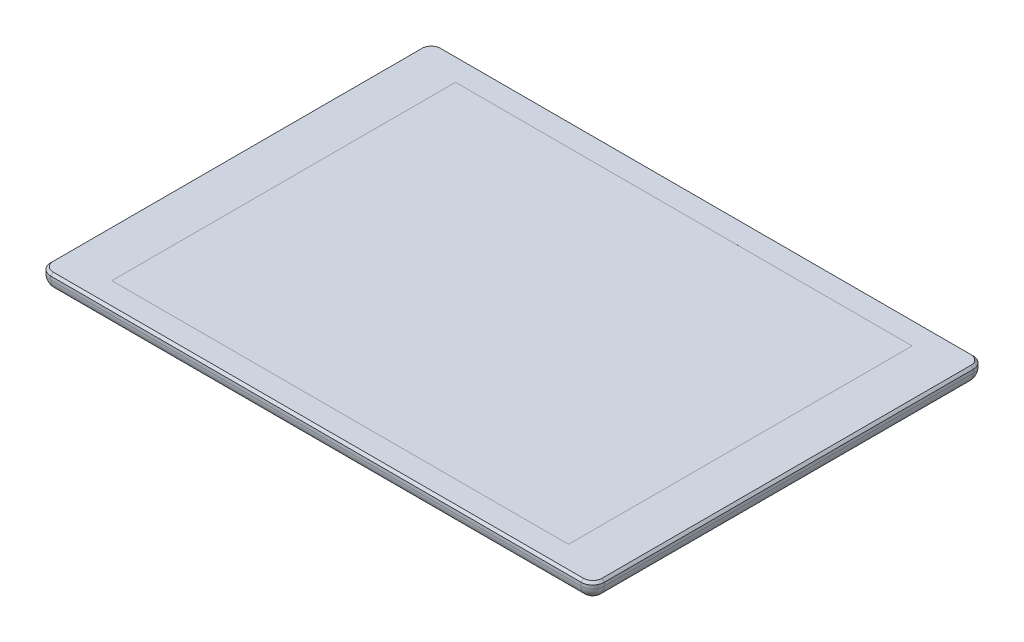
ISO-10303-21;
HEADER;
FILE_DESCRIPTION(('STEP AP214'),'2;1');
FILE_NAME('part.step','',(''),(''),'','','');
FILE_SCHEMA(('AUTOMOTIVE_DESIGN { 1 0 10303 214 1 1 1 1 }'));
ENDSEC;
DATA;
#1=APPLICATION_CONTEXT('core data for automotive mechanical design processes');
#2=APPLICATION_PROTOCOL_DEFINITION('international standard','automotive_design',2000,#1);
#3=PRODUCT_CONTEXT('',#1,'mechanical');
#4=PRODUCT('Part','Part','',(#3));
#5=PRODUCT_RELATED_PRODUCT_CATEGORY('part','',(#4));
#6=PRODUCT_DEFINITION_FORMATION('','',#4);
#7=PRODUCT_DEFINITION_CONTEXT('part definition',#1,'design');
#8=PRODUCT_DEFINITION('design','',#6,#7);
#9=PRODUCT_DEFINITION_SHAPE('','',#8);
#10=(LENGTH_UNIT() NAMED_UNIT(*) SI_UNIT(.MILLI.,.METRE.));
#11=(NAMED_UNIT(*) PLANE_ANGLE_UNIT() SI_UNIT($,.RADIAN.));
#12=(NAMED_UNIT(*) SI_UNIT($,.STERADIAN.) SOLID_ANGLE_UNIT());
#13=UNCERTAINTY_MEASURE_WITH_UNIT(LENGTH_MEASURE(1.E-05),#10,'distance_accuracy_value','');
#14=(GEOMETRIC_REPRESENTATION_CONTEXT(3) GLOBAL_UNCERTAINTY_ASSIGNED_CONTEXT((#13)) GLOBAL_UNIT_ASSIGNED_CONTEXT((#10,
#11,#12)) REPRESENTATION_CONTEXT('',''));
#15=CARTESIAN_POINT('',(0.,0.,0.));
#16=DIRECTION('',(0.,0.,1.));
#17=DIRECTION('',(1.,0.,0.));
#18=AXIS2_PLACEMENT_3D('',#15,#16,#17);
#19=CARTESIAN_POINT('',(5.,7.5,-5.));
#20=DIRECTION('',(0.,-1.,0.));
#21=DIRECTION('',(0.,0.,-1.));
#22=AXIS2_PLACEMENT_3D('',#19,#20,#21);
#23=CYLINDRICAL_SURFACE('',#22,5.);
#24=DIRECTION('',(0.,-1.,0.));
#25=VECTOR('',#24,1.);
#26=CARTESIAN_POINT('',(5.00000000000004,7.5,0.));
#27=LINE('',#26,#25);
#28=CARTESIAN_POINT('',(5.00000000000004,6.50000000000001,0.));
#29=VERTEX_POINT('',#28);
#30=CARTESIAN_POINT('',(5.00000000000004,5.,0.));
#31=VERTEX_POINT('',#30);
#32=EDGE_CURVE('E225',#29,#31,#27,.T.);
#33=ORIENTED_EDGE('',*,*,#32,.F.);
#34=CARTESIAN_POINT('',(5.,6.50000000000001,-5.));
#35=DIRECTION('',(0.,1.,0.));
#36=DIRECTION('',(0.,0.,1.));
#37=AXIS2_PLACEMENT_3D('',#34,#35,#36);
#38=CIRCLE('',#37,5.);
#39=CARTESIAN_POINT('',(0.,6.50000000000001,-5.00000000000004));
#40=VERTEX_POINT('',#39);
#41=EDGE_CURVE('E11',#29,#40,#38,.F.);
#42=ORIENTED_EDGE('',*,*,#41,.T.);
#43=DIRECTION('',(0.,-1.,0.));
#44=VECTOR('',#43,1.);
#45=CARTESIAN_POINT('',(0.,7.5,-5.00000000000004));
#46=LINE('',#45,#44);
#47=CARTESIAN_POINT('',(0.,5.,-5.00000000000004));
#48=VERTEX_POINT('',#47);
#49=EDGE_CURVE('E210',#40,#48,#46,.T.);
#50=ORIENTED_EDGE('',*,*,#49,.T.);
#51=CARTESIAN_POINT('',(5.,5.,-5.));
#52=DIRECTION('',(0.,-1.,0.));
#53=DIRECTION('',(0.,0.,-1.));
#54=AXIS2_PLACEMENT_3D('',#51,#52,#53);
#55=CIRCLE('',#54,5.);
#56=EDGE_CURVE('E257',#48,#31,#55,.F.);
#57=ORIENTED_EDGE('',*,*,#56,.T.);
#58=EDGE_LOOP('',(#33,#42,#50,#57));
#59=FACE_BOUND('',#58,.T.);
#60=ADVANCED_FACE('F43',(#59),#23,.T.);
#61=CARTESIAN_POINT('',(5.00000000000004,7.5,0.));
#62=DIRECTION('',(0.,0.,-1.));
#63=DIRECTION('',(-1.,0.,0.));
#64=AXIS2_PLACEMENT_3D('',#61,#62,#63);
#65=PLANE('',#64);
#66=DIRECTION('',(0.,-1.,0.));
#67=VECTOR('',#66,1.);
#68=CARTESIAN_POINT('',(235.,7.5,0.));
#69=LINE('',#68,#67);
#70=CARTESIAN_POINT('',(235.,6.50000000000001,0.));
#71=VERTEX_POINT('',#70);
#72=CARTESIAN_POINT('',(235.,5.,0.));
#73=VERTEX_POINT('',#72);
#74=EDGE_CURVE('E223',#71,#73,#69,.T.);
#75=ORIENTED_EDGE('',*,*,#74,.F.);
#76=DIRECTION('',(-1.,0.,0.));
#77=VECTOR('',#76,1.);
#78=CARTESIAN_POINT('',(5.00000000000004,6.50000000000001,0.));
#79=LINE('',#78,#77);
#80=EDGE_CURVE('E52',#71,#29,#79,.T.);
#81=ORIENTED_EDGE('',*,*,#80,.T.);
#82=ORIENTED_EDGE('',*,*,#32,.T.);
#83=DIRECTION('',(1.,0.,0.));
#84=VECTOR('',#83,1.);
#85=CARTESIAN_POINT('',(5.00000000000004,5.,0.));
#86=LINE('',#85,#84);
#87=EDGE_CURVE('E227',#31,#73,#86,.T.);
#88=ORIENTED_EDGE('',*,*,#87,.T.);
#89=EDGE_LOOP('',(#75,#81,#82,#88));
#90=FACE_BOUND('',#89,.T.);
#91=ADVANCED_FACE('F427',(#90),#65,.F.);
#92=CARTESIAN_POINT('',(235.,7.5,-5.));
#93=DIRECTION('',(0.,-1.,0.));
#94=DIRECTION('',(0.,0.,-1.));
#95=AXIS2_PLACEMENT_3D('',#92,#93,#94);
#96=CYLINDRICAL_SURFACE('',#95,5.);
#97=DIRECTION('',(0.,-1.,0.));
#98=VECTOR('',#97,1.);
#99=CARTESIAN_POINT('',(240.,7.5,-5.00000000000004));
#100=LINE('',#99,#98);
#101=CARTESIAN_POINT('',(240.,6.50000000000001,-5.00000000000004));
#102=VERTEX_POINT('',#101);
#103=CARTESIAN_POINT('',(240.,5.,-5.00000000000004));
#104=VERTEX_POINT('',#103);
#105=EDGE_CURVE('E221',#102,#104,#100,.T.);
#106=ORIENTED_EDGE('',*,*,#105,.F.);
#107=CARTESIAN_POINT('',(235.,6.50000000000001,-5.));
#108=DIRECTION('',(0.,1.,0.));
#109=DIRECTION('',(0.,0.,1.));
#110=AXIS2_PLACEMENT_3D('',#107,#108,#109);
#111=CIRCLE('',#110,5.);
#112=EDGE_CURVE('E310',#102,#71,#111,.F.);
#113=ORIENTED_EDGE('',*,*,#112,.T.);
#114=ORIENTED_EDGE('',*,*,#74,.T.);
#115=CARTESIAN_POINT('',(235.,5.,-5.));
#116=DIRECTION('',(0.,-1.,0.));
#117=DIRECTION('',(0.,0.,-1.));
#118=AXIS2_PLACEMENT_3D('',#115,#116,#117);
#119=CIRCLE('',#118,5.);
#120=EDGE_CURVE('E239',#73,#104,#119,.F.);
#121=ORIENTED_EDGE('',*,*,#120,.T.);
#122=EDGE_LOOP('',(#106,#113,#114,#121));
#123=FACE_BOUND('',#122,.T.);
#124=ADVANCED_FACE('F348',(#123),#96,.T.);
#125=CARTESIAN_POINT('',(240.,7.5,-5.00000000000004));
#126=DIRECTION('',(-1.,0.,0.));
#127=DIRECTION('',(0.,0.,1.));
#128=AXIS2_PLACEMENT_3D('',#125,#126,#127);
#129=PLANE('',#128);
#130=DIRECTION('',(0.,-1.,0.));
#131=VECTOR('',#130,1.);
#132=CARTESIAN_POINT('',(240.,7.5,-165.));
#133=LINE('',#132,#131);
#134=CARTESIAN_POINT('',(240.,6.50000000000001,-165.));
#135=VERTEX_POINT('',#134);
#136=CARTESIAN_POINT('',(240.,5.,-165.));
#137=VERTEX_POINT('',#136);
#138=EDGE_CURVE('E219',#135,#137,#133,.T.);
#139=ORIENTED_EDGE('',*,*,#138,.F.);
#140=DIRECTION('',(0.,0.,1.));
#141=VECTOR('',#140,1.);
#142=CARTESIAN_POINT('',(240.,6.50000000000001,-5.00000000000004));
#143=LINE('',#142,#141);
#144=EDGE_CURVE('E308',#135,#102,#143,.T.);
#145=ORIENTED_EDGE('',*,*,#144,.T.);
#146=ORIENTED_EDGE('',*,*,#105,.T.);
#147=DIRECTION('',(0.,0.,-1.));
#148=VECTOR('',#147,1.);
#149=CARTESIAN_POINT('',(240.,5.,-5.00000000000004));
#150=LINE('',#149,#148);
#151=EDGE_CURVE('E242',#104,#137,#150,.T.);
#152=ORIENTED_EDGE('',*,*,#151,.T.);
#153=EDGE_LOOP('',(#139,#145,#146,#152));
#154=FACE_BOUND('',#153,.T.);
#155=ADVANCED_FACE('F346',(#154),#129,.F.);
#156=CARTESIAN_POINT('',(235.,7.5,-165.));
#157=DIRECTION('',(0.,-1.,0.));
#158=DIRECTION('',(0.,0.,-1.));
#159=AXIS2_PLACEMENT_3D('',#156,#157,#158);
#160=CYLINDRICAL_SURFACE('',#159,5.);
#161=DIRECTION('',(0.,-1.,0.));
#162=VECTOR('',#161,1.);
#163=CARTESIAN_POINT('',(235.,7.5,-170.));
#164=LINE('',#163,#162);
#165=CARTESIAN_POINT('',(235.,6.50000000000001,-170.));
#166=VERTEX_POINT('',#165);
#167=CARTESIAN_POINT('',(235.,5.,-170.));
#168=VERTEX_POINT('',#167);
#169=EDGE_CURVE('E217',#166,#168,#164,.T.);
#170=ORIENTED_EDGE('',*,*,#169,.F.);
#171=CARTESIAN_POINT('',(235.,6.50000000000001,-165.));
#172=DIRECTION('',(0.,1.,0.));
#173=DIRECTION('',(0.,0.,1.));
#174=AXIS2_PLACEMENT_3D('',#171,#172,#173);
#175=CIRCLE('',#174,5.);
#176=EDGE_CURVE('E306',#166,#135,#175,.F.);
#177=ORIENTED_EDGE('',*,*,#176,.T.);
#178=ORIENTED_EDGE('',*,*,#138,.T.);
#179=CARTESIAN_POINT('',(235.,5.,-165.));
#180=DIRECTION('',(0.,-1.,0.));
#181=DIRECTION('',(0.,0.,-1.));
#182=AXIS2_PLACEMENT_3D('',#179,#180,#181);
#183=CIRCLE('',#182,5.);
#184=EDGE_CURVE('E245',#137,#168,#183,.F.);
#185=ORIENTED_EDGE('',*,*,#184,.T.);
#186=EDGE_LOOP('',(#170,#177,#178,#185));
#187=FACE_BOUND('',#186,.T.);
#188=ADVANCED_FACE('F378',(#187),#160,.T.);
#189=CARTESIAN_POINT('',(5.00000000000004,7.5,-170.));
#190=DIRECTION('',(0.,0.,1.));
#191=DIRECTION('',(1.,0.,0.));
#192=AXIS2_PLACEMENT_3D('',#189,#190,#191);
#193=PLANE('',#192);
#194=DIRECTION('',(0.,-1.,0.));
#195=VECTOR('',#194,1.);
#196=CARTESIAN_POINT('',(5.00000000000004,7.5,-170.));
#197=LINE('',#196,#195);
#198=CARTESIAN_POINT('',(5.00000000000004,6.50000000000001,-170.));
#199=VERTEX_POINT('',#198);
#200=CARTESIAN_POINT('',(5.00000000000004,5.,-170.));
#201=VERTEX_POINT('',#200);
#202=EDGE_CURVE('E215',#199,#201,#197,.T.);
#203=ORIENTED_EDGE('',*,*,#202,.F.);
#204=DIRECTION('',(1.,0.,0.));
#205=VECTOR('',#204,1.);
#206=CARTESIAN_POINT('',(235.,6.50000000000001,-170.));
#207=LINE('',#206,#205);
#208=EDGE_CURVE('E304',#199,#166,#207,.T.);
#209=ORIENTED_EDGE('',*,*,#208,.T.);
#210=ORIENTED_EDGE('',*,*,#169,.T.);
#211=DIRECTION('',(-1.,0.,0.));
#212=VECTOR('',#211,1.);
#213=CARTESIAN_POINT('',(5.00000000000004,5.,-170.));
#214=LINE('',#213,#212);
#215=EDGE_CURVE('E248',#168,#201,#214,.T.);
#216=ORIENTED_EDGE('',*,*,#215,.T.);
#217=EDGE_LOOP('',(#203,#209,#210,#216));
#218=FACE_BOUND('',#217,.T.);
#219=ADVANCED_FACE('F381',(#218),#193,.F.);
#220=CARTESIAN_POINT('',(5.,7.5,-165.));
#221=DIRECTION('',(0.,-1.,0.));
#222=DIRECTION('',(0.,0.,-1.));
#223=AXIS2_PLACEMENT_3D('',#220,#221,#222);
#224=CYLINDRICAL_SURFACE('',#223,5.);
#225=DIRECTION('',(0.,-1.,0.));
#226=VECTOR('',#225,1.);
#227=CARTESIAN_POINT('',(0.,7.5,-165.));
#228=LINE('',#227,#226);
#229=CARTESIAN_POINT('',(0.,6.50000000000001,-165.));
#230=VERTEX_POINT('',#229);
#231=CARTESIAN_POINT('',(0.,5.,-165.));
#232=VERTEX_POINT('',#231);
#233=EDGE_CURVE('E212',#230,#232,#228,.T.);
#234=ORIENTED_EDGE('',*,*,#233,.F.);
#235=CARTESIAN_POINT('',(5.,6.50000000000001,-165.));
#236=DIRECTION('',(0.,1.,0.));
#237=DIRECTION('',(0.,0.,1.));
#238=AXIS2_PLACEMENT_3D('',#235,#236,#237);
#239=CIRCLE('',#238,5.);
#240=EDGE_CURVE('E302',#230,#199,#239,.F.);
#241=ORIENTED_EDGE('',*,*,#240,.T.);
#242=ORIENTED_EDGE('',*,*,#202,.T.);
#243=CARTESIAN_POINT('',(5.,5.,-165.));
#244=DIRECTION('',(0.,-1.,0.));
#245=DIRECTION('',(0.,0.,-1.));
#246=AXIS2_PLACEMENT_3D('',#243,#244,#245);
#247=CIRCLE('',#246,5.);
#248=EDGE_CURVE('E251',#201,#232,#247,.F.);
#249=ORIENTED_EDGE('',*,*,#248,.T.);
#250=EDGE_LOOP('',(#234,#241,#242,#249));
#251=FACE_BOUND('',#250,.T.);
#252=ADVANCED_FACE('F467',(#251),#224,.T.);
#253=CARTESIAN_POINT('',(0.,7.5,-5.00000000000004));
#254=DIRECTION('',(1.,0.,0.));
#255=DIRECTION('',(0.,0.,-1.));
#256=AXIS2_PLACEMENT_3D('',#253,#254,#255);
#257=PLANE('',#256);
#258=ORIENTED_EDGE('',*,*,#49,.F.);
#259=DIRECTION('',(0.,0.,-1.));
#260=VECTOR('',#259,1.);
#261=CARTESIAN_POINT('',(0.,6.50000000000001,-165.));
#262=LINE('',#261,#260);
#263=EDGE_CURVE('E299',#40,#230,#262,.T.);
#264=ORIENTED_EDGE('',*,*,#263,.T.);
#265=ORIENTED_EDGE('',*,*,#233,.T.);
#266=DIRECTION('',(0.,0.,1.));
#267=VECTOR('',#266,1.);
#268=CARTESIAN_POINT('',(0.,5.,-5.00000000000004));
#269=LINE('',#268,#267);
#270=EDGE_CURVE('E254',#232,#48,#269,.T.);
#271=ORIENTED_EDGE('',*,*,#270,.T.);
#272=EDGE_LOOP('',(#258,#264,#265,#271));
#273=FACE_BOUND('',#272,.T.);
#274=ADVANCED_FACE('F410',(#273),#257,.F.);
#275=CARTESIAN_POINT('',(5.,7.5,-5.));
#276=DIRECTION('',(0.,1.,0.));
#277=DIRECTION('',(0.,0.,1.));
#278=AXIS2_PLACEMENT_3D('',#275,#276,#277);
#279=PLANE('',#278);
#280=DIRECTION('',(0.,0.,1.));
#281=VECTOR('',#280,1.);
#282=CARTESIAN_POINT('',(21.,7.5,-10.5));
#283=LINE('',#282,#281);
#284=CARTESIAN_POINT('',(21.,7.5,-159.5));
#285=VERTEX_POINT('',#284);
#286=CARTESIAN_POINT('',(21.,7.5,-10.5));
#287=VERTEX_POINT('',#286);
#288=EDGE_CURVE('E60',#285,#287,#283,.T.);
#289=ORIENTED_EDGE('',*,*,#288,.F.);
#290=DIRECTION('',(-1.,0.,0.));
#291=VECTOR('',#290,1.);
#292=CARTESIAN_POINT('',(21.,7.5,-159.5));
#293=LINE('',#292,#291);
#294=CARTESIAN_POINT('',(219.,7.5,-159.5));
#295=VERTEX_POINT('',#294);
#296=EDGE_CURVE('E190',#295,#285,#293,.T.);
#297=ORIENTED_EDGE('',*,*,#296,.F.);
#298=DIRECTION('',(0.,0.,-1.));
#299=VECTOR('',#298,1.);
#300=CARTESIAN_POINT('',(219.,7.5,-10.5));
#301=LINE('',#300,#299);
#302=CARTESIAN_POINT('',(219.,7.5,-10.5));
#303=VERTEX_POINT('',#302);
#304=EDGE_CURVE('E194',#303,#295,#301,.T.);
#305=ORIENTED_EDGE('',*,*,#304,.F.);
#306=DIRECTION('',(1.,0.,0.));
#307=VECTOR('',#306,1.);
#308=CARTESIAN_POINT('',(21.,7.5,-10.5));
#309=LINE('',#308,#307);
#310=EDGE_CURVE('E200',#287,#303,#309,.T.);
#311=ORIENTED_EDGE('',*,*,#310,.F.);
#312=EDGE_LOOP('',(#289,#297,#305,#311));
#313=FACE_BOUND('',#312,.T.);
#314=CARTESIAN_POINT('',(5.,7.5,-165.));
#315=DIRECTION('',(0.,1.,0.));
#316=DIRECTION('',(0.,0.,1.));
#317=AXIS2_PLACEMENT_3D('',#314,#315,#316);
#318=CIRCLE('',#317,4.00000000000003);
#319=CARTESIAN_POINT('',(5.00000000000003,7.5,-169.));
#320=VERTEX_POINT('',#319);
#321=CARTESIAN_POINT('',(0.999999999999972,7.5,-165.));
#322=VERTEX_POINT('',#321);
#323=EDGE_CURVE('E294',#320,#322,#318,.T.);
#324=ORIENTED_EDGE('',*,*,#323,.T.);
#325=DIRECTION('',(0.,0.,1.));
#326=VECTOR('',#325,1.);
#327=CARTESIAN_POINT('',(0.999999999999976,7.5,-5.00000000000004));
#328=LINE('',#327,#326);
#329=CARTESIAN_POINT('',(0.999999999999976,7.5,-5.00000000000004));
#330=VERTEX_POINT('',#329);
#331=EDGE_CURVE('E296',#322,#330,#328,.T.);
#332=ORIENTED_EDGE('',*,*,#331,.T.);
#333=CARTESIAN_POINT('',(5.,7.5,-5.));
#334=DIRECTION('',(0.,1.,0.));
#335=DIRECTION('',(0.,0.,1.));
#336=AXIS2_PLACEMENT_3D('',#333,#334,#335);
#337=CIRCLE('',#336,4.00000000000002);
#338=CARTESIAN_POINT('',(5.00000000000004,7.5,-0.999999999999976));
#339=VERTEX_POINT('',#338);
#340=EDGE_CURVE('E260',#330,#339,#337,.T.);
#341=ORIENTED_EDGE('',*,*,#340,.T.);
#342=DIRECTION('',(1.,0.,0.));
#343=VECTOR('',#342,1.);
#344=CARTESIAN_POINT('',(235.,7.5,-0.999999999999976));
#345=LINE('',#344,#343);
#346=CARTESIAN_POINT('',(235.,7.5,-0.999999999999976));
#347=VERTEX_POINT('',#346);
#348=EDGE_CURVE('E284',#339,#347,#345,.T.);
#349=ORIENTED_EDGE('',*,*,#348,.T.);
#350=CARTESIAN_POINT('',(235.,7.5,-5.));
#351=DIRECTION('',(0.,1.,0.));
#352=DIRECTION('',(0.,0.,1.));
#353=AXIS2_PLACEMENT_3D('',#350,#351,#352);
#354=CIRCLE('',#353,4.00000000000003);
#355=CARTESIAN_POINT('',(239.,7.5,-5.00000000000004));
#356=VERTEX_POINT('',#355);
#357=EDGE_CURVE('E286',#347,#356,#354,.T.);
#358=ORIENTED_EDGE('',*,*,#357,.T.);
#359=DIRECTION('',(0.,0.,-1.));
#360=VECTOR('',#359,1.);
#361=CARTESIAN_POINT('',(239.,7.5,-165.));
#362=LINE('',#361,#360);
#363=CARTESIAN_POINT('',(239.,7.5,-165.));
#364=VERTEX_POINT('',#363);
#365=EDGE_CURVE('E288',#356,#364,#362,.T.);
#366=ORIENTED_EDGE('',*,*,#365,.T.);
#367=CARTESIAN_POINT('',(235.,7.5,-165.));
#368=DIRECTION('',(0.,1.,0.));
#369=DIRECTION('',(0.,0.,1.));
#370=AXIS2_PLACEMENT_3D('',#367,#368,#369);
#371=CIRCLE('',#370,4.00000000000003);
#372=CARTESIAN_POINT('',(235.,7.5,-169.));
#373=VERTEX_POINT('',#372);
#374=EDGE_CURVE('E290',#364,#373,#371,.T.);
#375=ORIENTED_EDGE('',*,*,#374,.T.);
#376=DIRECTION('',(-1.,0.,0.));
#377=VECTOR('',#376,1.);
#378=CARTESIAN_POINT('',(5.00000000000004,7.5,-169.));
#379=LINE('',#378,#377);
#380=EDGE_CURVE('E292',#373,#320,#379,.T.);
#381=ORIENTED_EDGE('',*,*,#380,.T.);
#382=EDGE_LOOP('',(#324,#332,#341,#349,#358,#366,#375,#381));
#383=FACE_BOUND('',#382,.T.);
#384=ADVANCED_FACE('F394',(#313,#383),#279,.T.);
#385=CARTESIAN_POINT('',(5.,0.,-5.));
#386=DIRECTION('',(0.,1.,0.));
#387=DIRECTION('',(0.,0.,1.));
#388=AXIS2_PLACEMENT_3D('',#385,#386,#387);
#389=PLANE('',#388);
#390=DIRECTION('',(0.,0.,-1.));
#391=VECTOR('',#390,1.);
#392=CARTESIAN_POINT('',(235.,0.,-5.));
#393=LINE('',#392,#391);
#394=CARTESIAN_POINT('',(235.,0.,-165.));
#395=VERTEX_POINT('',#394);
#396=CARTESIAN_POINT('',(235.,0.,-5.));
#397=VERTEX_POINT('',#396);
#398=EDGE_CURVE('E234',#395,#397,#393,.F.);
#399=ORIENTED_EDGE('',*,*,#398,.T.);
#400=DIRECTION('',(1.,0.,0.));
#401=VECTOR('',#400,1.);
#402=CARTESIAN_POINT('',(5.,0.,-5.));
#403=LINE('',#402,#401);
#404=CARTESIAN_POINT('',(5.,0.,-5.00000000000004));
#405=VERTEX_POINT('',#404);
#406=EDGE_CURVE('E236',#397,#405,#403,.F.);
#407=ORIENTED_EDGE('',*,*,#406,.T.);
#408=DIRECTION('',(0.,0.,1.));
#409=VECTOR('',#408,1.);
#410=CARTESIAN_POINT('',(5.,0.,-5.));
#411=LINE('',#410,#409);
#412=CARTESIAN_POINT('',(5.,0.,-165.));
#413=VERTEX_POINT('',#412);
#414=EDGE_CURVE('E230',#405,#413,#411,.F.);
#415=ORIENTED_EDGE('',*,*,#414,.T.);
#416=DIRECTION('',(-1.,0.,0.));
#417=VECTOR('',#416,1.);
#418=CARTESIAN_POINT('',(5.,0.,-165.));
#419=LINE('',#418,#417);
#420=EDGE_CURVE('E232',#413,#395,#419,.F.);
#421=ORIENTED_EDGE('',*,*,#420,.T.);
#422=EDGE_LOOP('',(#399,#407,#415,#421));
#423=FACE_BOUND('',#422,.T.);
#424=ADVANCED_FACE('F366',(#423),#389,.F.);
#425=CARTESIAN_POINT('',(5.00000000000004,5.,-165.));
#426=DIRECTION('',(-1.,0.,0.));
#427=DIRECTION('',(0.,0.,1.));
#428=AXIS2_PLACEMENT_3D('',#425,#426,#427);
#429=CYLINDRICAL_SURFACE('',#428,5.);
#430=CARTESIAN_POINT('',(5.00000000000004,5.,-165.));
#431=DIRECTION('',(-1.,0.,0.));
#432=DIRECTION('',(0.,0.,1.));
#433=AXIS2_PLACEMENT_3D('',#430,#431,#432);
#434=CIRCLE('',#433,5.);
#435=EDGE_CURVE('E213',#201,#413,#434,.T.);
#436=ORIENTED_EDGE('',*,*,#435,.F.);
#437=ORIENTED_EDGE('',*,*,#215,.F.);
#438=CARTESIAN_POINT('',(235.,5.,-165.));
#439=DIRECTION('',(1.,0.,0.));
#440=DIRECTION('',(0.,0.,-1.));
#441=AXIS2_PLACEMENT_3D('',#438,#439,#440);
#442=CIRCLE('',#441,5.);
#443=EDGE_CURVE('E278',#395,#168,#442,.T.);
#444=ORIENTED_EDGE('',*,*,#443,.F.);
#445=ORIENTED_EDGE('',*,*,#420,.F.);
#446=EDGE_LOOP('',(#436,#437,#444,#445));
#447=FACE_BOUND('',#446,.T.);
#448=ADVANCED_FACE('F373',(#447),#429,.T.);
#449=CARTESIAN_POINT('',(5.,5.,-165.));
#450=DIRECTION('',(0.,0.,1.));
#451=DIRECTION('',(1.,0.,0.));
#452=AXIS2_PLACEMENT_3D('',#449,#450,#451);
#453=SPHERICAL_SURFACE('',#452,5.);
#454=ORIENTED_EDGE('',*,*,#248,.F.);
#455=ORIENTED_EDGE('',*,*,#435,.T.);
#456=CARTESIAN_POINT('',(5.,5.,-165.));
#457=DIRECTION('',(0.,0.,1.));
#458=DIRECTION('',(1.,0.,0.));
#459=AXIS2_PLACEMENT_3D('',#456,#457,#458);
#460=CIRCLE('',#459,5.);
#461=EDGE_CURVE('E275',#232,#413,#460,.T.);
#462=ORIENTED_EDGE('',*,*,#461,.F.);
#463=EDGE_LOOP('',(#454,#455,#462));
#464=FACE_BOUND('',#463,.T.);
#465=ADVANCED_FACE('F451',(#464),#453,.T.);
#466=CARTESIAN_POINT('',(235.,5.,-165.));
#467=DIRECTION('',(0.,0.,1.));
#468=DIRECTION('',(1.,0.,0.));
#469=AXIS2_PLACEMENT_3D('',#466,#467,#468);
#470=SPHERICAL_SURFACE('',#469,5.);
#471=ORIENTED_EDGE('',*,*,#443,.T.);
#472=ORIENTED_EDGE('',*,*,#184,.F.);
#473=CARTESIAN_POINT('',(235.,5.,-165.));
#474=DIRECTION('',(0.,0.,1.));
#475=DIRECTION('',(1.,0.,0.));
#476=AXIS2_PLACEMENT_3D('',#473,#474,#475);
#477=CIRCLE('',#476,5.);
#478=EDGE_CURVE('E272',#395,#137,#477,.T.);
#479=ORIENTED_EDGE('',*,*,#478,.F.);
#480=EDGE_LOOP('',(#471,#472,#479));
#481=FACE_BOUND('',#480,.T.);
#482=ADVANCED_FACE('F375',(#481),#470,.T.);
#483=CARTESIAN_POINT('',(5.,5.,-5.00000000000004));
#484=DIRECTION('',(0.,0.,1.));
#485=DIRECTION('',(1.,0.,0.));
#486=AXIS2_PLACEMENT_3D('',#483,#484,#485);
#487=CYLINDRICAL_SURFACE('',#486,5.);
#488=ORIENTED_EDGE('',*,*,#461,.T.);
#489=ORIENTED_EDGE('',*,*,#414,.F.);
#490=CARTESIAN_POINT('',(5.,5.,-5.00000000000004));
#491=DIRECTION('',(0.,0.,1.));
#492=DIRECTION('',(1.,0.,0.));
#493=AXIS2_PLACEMENT_3D('',#490,#491,#492);
#494=CIRCLE('',#493,5.);
#495=EDGE_CURVE('E269',#48,#405,#494,.T.);
#496=ORIENTED_EDGE('',*,*,#495,.F.);
#497=ORIENTED_EDGE('',*,*,#270,.F.);
#498=EDGE_LOOP('',(#488,#489,#496,#497));
#499=FACE_BOUND('',#498,.T.);
#500=ADVANCED_FACE('F445',(#499),#487,.T.);
#501=CARTESIAN_POINT('',(235.,5.,-5.00000000000004));
#502=DIRECTION('',(0.,0.,-1.));
#503=DIRECTION('',(-1.,0.,0.));
#504=AXIS2_PLACEMENT_3D('',#501,#502,#503);
#505=CYLINDRICAL_SURFACE('',#504,5.);
#506=ORIENTED_EDGE('',*,*,#478,.T.);
#507=ORIENTED_EDGE('',*,*,#151,.F.);
#508=CARTESIAN_POINT('',(235.,5.,-5.));
#509=DIRECTION('',(0.,0.,1.));
#510=DIRECTION('',(1.,0.,0.));
#511=AXIS2_PLACEMENT_3D('',#508,#509,#510);
#512=CIRCLE('',#511,5.);
#513=EDGE_CURVE('E266',#397,#104,#512,.T.);
#514=ORIENTED_EDGE('',*,*,#513,.F.);
#515=ORIENTED_EDGE('',*,*,#398,.F.);
#516=EDGE_LOOP('',(#506,#507,#514,#515));
#517=FACE_BOUND('',#516,.T.);
#518=ADVANCED_FACE('F355',(#517),#505,.T.);
#519=CARTESIAN_POINT('',(5.,5.,-5.));
#520=DIRECTION('',(0.,0.,1.));
#521=DIRECTION('',(1.,0.,0.));
#522=AXIS2_PLACEMENT_3D('',#519,#520,#521);
#523=SPHERICAL_SURFACE('',#522,5.);
#524=ORIENTED_EDGE('',*,*,#56,.F.);
#525=ORIENTED_EDGE('',*,*,#495,.T.);
#526=CARTESIAN_POINT('',(5.,5.,-5.));
#527=DIRECTION('',(1.,0.,0.));
#528=DIRECTION('',(0.,0.,-1.));
#529=AXIS2_PLACEMENT_3D('',#526,#527,#528);
#530=CIRCLE('',#529,5.);
#531=EDGE_CURVE('E264',#31,#405,#530,.T.);
#532=ORIENTED_EDGE('',*,*,#531,.F.);
#533=EDGE_LOOP('',(#524,#525,#532));
#534=FACE_BOUND('',#533,.T.);
#535=ADVANCED_FACE('F439',(#534),#523,.T.);
#536=CARTESIAN_POINT('',(235.,5.,-5.));
#537=DIRECTION('',(0.,0.,1.));
#538=DIRECTION('',(1.,0.,0.));
#539=AXIS2_PLACEMENT_3D('',#536,#537,#538);
#540=SPHERICAL_SURFACE('',#539,5.);
#541=ORIENTED_EDGE('',*,*,#513,.T.);
#542=ORIENTED_EDGE('',*,*,#120,.F.);
#543=CARTESIAN_POINT('',(235.,5.,-5.));
#544=DIRECTION('',(-1.,0.,0.));
#545=DIRECTION('',(0.,0.,1.));
#546=AXIS2_PLACEMENT_3D('',#543,#544,#545);
#547=CIRCLE('',#546,5.);
#548=EDGE_CURVE('E261',#397,#73,#547,.T.);
#549=ORIENTED_EDGE('',*,*,#548,.F.);
#550=EDGE_LOOP('',(#541,#542,#549));
#551=FACE_BOUND('',#550,.T.);
#552=ADVANCED_FACE('F360',(#551),#540,.T.);
#553=CARTESIAN_POINT('',(5.00000000000004,5.,-5.));
#554=DIRECTION('',(1.,0.,0.));
#555=DIRECTION('',(0.,0.,-1.));
#556=AXIS2_PLACEMENT_3D('',#553,#554,#555);
#557=CYLINDRICAL_SURFACE('',#556,5.);
#558=ORIENTED_EDGE('',*,*,#531,.T.);
#559=ORIENTED_EDGE('',*,*,#406,.F.);
#560=ORIENTED_EDGE('',*,*,#548,.T.);
#561=ORIENTED_EDGE('',*,*,#87,.F.);
#562=EDGE_LOOP('',(#558,#559,#560,#561));
#563=FACE_BOUND('',#562,.T.);
#564=ADVANCED_FACE('F363',(#563),#557,.T.);
#565=CARTESIAN_POINT('',(239.,7.5,-5.));
#566=DIRECTION('',(0.707106781186552,0.707106781186543,0.));
#567=DIRECTION('',(0.,0.,1.));
#568=AXIS2_PLACEMENT_3D('',#565,#566,#567);
#569=PLANE('',#568);
#570=DIRECTION('',(-0.707106781186543,0.707106781186552,0.));
#571=VECTOR('',#570,1.);
#572=CARTESIAN_POINT('',(240.,6.50000000000001,-5.00000000000004));
#573=LINE('',#572,#571);
#574=EDGE_CURVE('E327',#102,#356,#573,.T.);
#575=ORIENTED_EDGE('',*,*,#574,.F.);
#576=ORIENTED_EDGE('',*,*,#144,.F.);
#577=DIRECTION('',(0.707106781186543,-0.707106781186552,0.));
#578=VECTOR('',#577,1.);
#579=CARTESIAN_POINT('',(239.,7.5,-165.));
#580=LINE('',#579,#578);
#581=EDGE_CURVE('E47',#364,#135,#580,.T.);
#582=ORIENTED_EDGE('',*,*,#581,.F.);
#583=ORIENTED_EDGE('',*,*,#365,.F.);
#584=EDGE_LOOP('',(#575,#576,#582,#583));
#585=FACE_BOUND('',#584,.T.);
#586=ADVANCED_FACE('F45',(#585),#569,.T.);
#587=CARTESIAN_POINT('',(235.,7.5,-165.));
#588=DIRECTION('',(0.,-1.,0.));
#589=DIRECTION('',(0.,0.,-1.));
#590=AXIS2_PLACEMENT_3D('',#587,#588,#589);
#591=CONICAL_SURFACE('',#590,4.00000000000003,0.785398163397441);
#592=ORIENTED_EDGE('',*,*,#581,.T.);
#593=ORIENTED_EDGE('',*,*,#176,.F.);
#594=DIRECTION('',(0.,-0.707106781186552,-0.707106781186543));
#595=VECTOR('',#594,1.);
#596=CARTESIAN_POINT('',(235.,7.5,-169.));
#597=LINE('',#596,#595);
#598=EDGE_CURVE('E325',#373,#166,#597,.T.);
#599=ORIENTED_EDGE('',*,*,#598,.F.);
#600=ORIENTED_EDGE('',*,*,#374,.F.);
#601=EDGE_LOOP('',(#592,#593,#599,#600));
#602=FACE_BOUND('',#601,.T.);
#603=ADVANCED_FACE('F338',(#602),#591,.T.);
#604=CARTESIAN_POINT('',(235.,7.5,-5.));
#605=DIRECTION('',(0.,-1.,0.));
#606=DIRECTION('',(0.,0.,-1.));
#607=AXIS2_PLACEMENT_3D('',#604,#605,#606);
#608=CONICAL_SURFACE('',#607,4.00000000000003,0.785398163397441);
#609=ORIENTED_EDGE('',*,*,#574,.T.);
#610=ORIENTED_EDGE('',*,*,#357,.F.);
#611=DIRECTION('',(0.,0.707106781186553,-0.707106781186542));
#612=VECTOR('',#611,1.);
#613=CARTESIAN_POINT('',(235.,6.50000000000001,0.));
#614=LINE('',#613,#612);
#615=EDGE_CURVE('E322',#71,#347,#614,.T.);
#616=ORIENTED_EDGE('',*,*,#615,.F.);
#617=ORIENTED_EDGE('',*,*,#112,.F.);
#618=EDGE_LOOP('',(#609,#610,#616,#617));
#619=FACE_BOUND('',#618,.T.);
#620=ADVANCED_FACE('F397',(#619),#608,.T.);
#621=CARTESIAN_POINT('',(5.,7.5,-169.));
#622=DIRECTION('',(0.,0.707106781186543,-0.707106781186552));
#623=DIRECTION('',(1.,0.,0.));
#624=AXIS2_PLACEMENT_3D('',#621,#622,#623);
#625=PLANE('',#624);
#626=ORIENTED_EDGE('',*,*,#598,.T.);
#627=ORIENTED_EDGE('',*,*,#208,.F.);
#628=DIRECTION('',(0.,-0.707106781186552,-0.707106781186543));
#629=VECTOR('',#628,1.);
#630=CARTESIAN_POINT('',(5.00000000000003,7.5,-169.));
#631=LINE('',#630,#629);
#632=EDGE_CURVE('E319',#320,#199,#631,.T.);
#633=ORIENTED_EDGE('',*,*,#632,.F.);
#634=ORIENTED_EDGE('',*,*,#380,.F.);
#635=EDGE_LOOP('',(#626,#627,#633,#634));
#636=FACE_BOUND('',#635,.T.);
#637=ADVANCED_FACE('F385',(#636),#625,.T.);
#638=CARTESIAN_POINT('',(5.,7.5,-0.999999999999976));
#639=DIRECTION('',(0.,0.707106781186543,0.707106781186551));
#640=DIRECTION('',(-1.,0.,0.));
#641=AXIS2_PLACEMENT_3D('',#638,#639,#640);
#642=PLANE('',#641);
#643=ORIENTED_EDGE('',*,*,#615,.T.);
#644=ORIENTED_EDGE('',*,*,#348,.F.);
#645=DIRECTION('',(0.,0.707106781186551,-0.707106781186543));
#646=VECTOR('',#645,1.);
#647=CARTESIAN_POINT('',(5.00000000000004,6.50000000000001,0.));
#648=LINE('',#647,#646);
#649=EDGE_CURVE('E316',#29,#339,#648,.T.);
#650=ORIENTED_EDGE('',*,*,#649,.F.);
#651=ORIENTED_EDGE('',*,*,#80,.F.);
#652=EDGE_LOOP('',(#643,#644,#650,#651));
#653=FACE_BOUND('',#652,.T.);
#654=ADVANCED_FACE('F399',(#653),#642,.T.);
#655=CARTESIAN_POINT('',(5.,7.5,-165.));
#656=DIRECTION('',(0.,-1.,0.));
#657=DIRECTION('',(0.,0.,-1.));
#658=AXIS2_PLACEMENT_3D('',#655,#656,#657);
#659=CONICAL_SURFACE('',#658,4.00000000000003,0.785398163397442);
#660=ORIENTED_EDGE('',*,*,#632,.T.);
#661=ORIENTED_EDGE('',*,*,#240,.F.);
#662=DIRECTION('',(-0.707106781186543,-0.707106781186552,0.));
#663=VECTOR('',#662,1.);
#664=CARTESIAN_POINT('',(0.999999999999972,7.5,-165.));
#665=LINE('',#664,#663);
#666=EDGE_CURVE('E314',#322,#230,#665,.T.);
#667=ORIENTED_EDGE('',*,*,#666,.F.);
#668=ORIENTED_EDGE('',*,*,#323,.F.);
#669=EDGE_LOOP('',(#660,#661,#667,#668));
#670=FACE_BOUND('',#669,.T.);
#671=ADVANCED_FACE('F390',(#670),#659,.T.);
#672=CARTESIAN_POINT('',(5.,7.5,-5.));
#673=DIRECTION('',(0.,-1.,0.));
#674=DIRECTION('',(0.,0.,-1.));
#675=AXIS2_PLACEMENT_3D('',#672,#673,#674);
#676=CONICAL_SURFACE('',#675,4.00000000000002,0.785398163397443);
#677=ORIENTED_EDGE('',*,*,#649,.T.);
#678=ORIENTED_EDGE('',*,*,#340,.F.);
#679=DIRECTION('',(0.707106781186543,0.707106781186551,0.));
#680=VECTOR('',#679,1.);
#681=CARTESIAN_POINT('',(0.,6.50000000000001,-5.00000000000004));
#682=LINE('',#681,#680);
#683=EDGE_CURVE('E206',#40,#330,#682,.T.);
#684=ORIENTED_EDGE('',*,*,#683,.F.);
#685=ORIENTED_EDGE('',*,*,#41,.F.);
#686=EDGE_LOOP('',(#677,#678,#684,#685));
#687=FACE_BOUND('',#686,.T.);
#688=ADVANCED_FACE('F405',(#687),#676,.T.);
#689=CARTESIAN_POINT('',(0.999999999999976,7.5,-5.));
#690=DIRECTION('',(-0.707106781186551,0.707106781186543,0.));
#691=DIRECTION('',(0.,0.,-1.));
#692=AXIS2_PLACEMENT_3D('',#689,#690,#691);
#693=PLANE('',#692);
#694=ORIENTED_EDGE('',*,*,#666,.T.);
#695=ORIENTED_EDGE('',*,*,#263,.F.);
#696=ORIENTED_EDGE('',*,*,#683,.T.);
#697=ORIENTED_EDGE('',*,*,#331,.F.);
#698=EDGE_LOOP('',(#694,#695,#696,#697));
#699=FACE_BOUND('',#698,.T.);
#700=ADVANCED_FACE('F415',(#699),#693,.T.);
#701=CARTESIAN_POINT('',(21.,7.4999,-10.5));
#702=DIRECTION('',(-1.,0.,0.));
#703=DIRECTION('',(0.,0.,1.));
#704=AXIS2_PLACEMENT_3D('',#701,#702,#703);
#705=PLANE('',#704);
#706=ORIENTED_EDGE('',*,*,#288,.T.);
#707=DIRECTION('',(0.,1.,0.));
#708=VECTOR('',#707,1.);
#709=CARTESIAN_POINT('',(21.,7.4999,-10.5));
#710=LINE('',#709,#708);
#711=CARTESIAN_POINT('',(21.,7.4999,-10.5));
#712=VERTEX_POINT('',#711);
#713=EDGE_CURVE('E167',#712,#287,#710,.T.);
#714=ORIENTED_EDGE('',*,*,#713,.F.);
#715=DIRECTION('',(0.,0.,1.));
#716=VECTOR('',#715,1.);
#717=CARTESIAN_POINT('',(21.,7.4999,-10.5));
#718=LINE('',#717,#716);
#719=CARTESIAN_POINT('',(21.,7.4999,-159.5));
#720=VERTEX_POINT('',#719);
#721=EDGE_CURVE('E171',#720,#712,#718,.T.);
#722=ORIENTED_EDGE('',*,*,#721,.F.);
#723=DIRECTION('',(0.,1.,0.));
#724=VECTOR('',#723,1.);
#725=CARTESIAN_POINT('',(21.,7.4999,-159.5));
#726=LINE('',#725,#724);
#727=EDGE_CURVE('E204',#720,#285,#726,.T.);
#728=ORIENTED_EDGE('',*,*,#727,.T.);
#729=EDGE_LOOP('',(#706,#714,#722,#728));
#730=FACE_BOUND('',#729,.T.);
#731=ADVANCED_FACE('F169',(#730),#705,.F.);
#732=CARTESIAN_POINT('',(21.,7.4999,-159.5));
#733=DIRECTION('',(0.,0.,-1.));
#734=DIRECTION('',(-1.,0.,0.));
#735=AXIS2_PLACEMENT_3D('',#732,#733,#734);
#736=PLANE('',#735);
#737=ORIENTED_EDGE('',*,*,#296,.T.);
#738=ORIENTED_EDGE('',*,*,#727,.F.);
#739=DIRECTION('',(-1.,0.,0.));
#740=VECTOR('',#739,1.);
#741=CARTESIAN_POINT('',(21.,7.4999,-159.5));
#742=LINE('',#741,#740);
#743=CARTESIAN_POINT('',(219.,7.4999,-159.5));
#744=VERTEX_POINT('',#743);
#745=EDGE_CURVE('E177',#744,#720,#742,.T.);
#746=ORIENTED_EDGE('',*,*,#745,.F.);
#747=DIRECTION('',(0.,1.,0.));
#748=VECTOR('',#747,1.);
#749=CARTESIAN_POINT('',(219.,7.4999,-159.5));
#750=LINE('',#749,#748);
#751=EDGE_CURVE('E207',#744,#295,#750,.T.);
#752=ORIENTED_EDGE('',*,*,#751,.T.);
#753=EDGE_LOOP('',(#737,#738,#746,#752));
#754=FACE_BOUND('',#753,.T.);
#755=ADVANCED_FACE('F422',(#754),#736,.F.);
#756=CARTESIAN_POINT('',(219.,7.4999,-10.5));
#757=DIRECTION('',(1.,0.,0.));
#758=DIRECTION('',(0.,0.,-1.));
#759=AXIS2_PLACEMENT_3D('',#756,#757,#758);
#760=PLANE('',#759);
#761=ORIENTED_EDGE('',*,*,#304,.T.);
#762=ORIENTED_EDGE('',*,*,#751,.F.);
#763=DIRECTION('',(0.,0.,-1.));
#764=VECTOR('',#763,1.);
#765=CARTESIAN_POINT('',(219.,7.4999,-10.5));
#766=LINE('',#765,#764);
#767=CARTESIAN_POINT('',(219.,7.4999,-10.5));
#768=VERTEX_POINT('',#767);
#769=EDGE_CURVE('E185',#768,#744,#766,.T.);
#770=ORIENTED_EDGE('',*,*,#769,.F.);
#771=DIRECTION('',(0.,1.,0.));
#772=VECTOR('',#771,1.);
#773=CARTESIAN_POINT('',(219.,7.4999,-10.5));
#774=LINE('',#773,#772);
#775=EDGE_CURVE('E176',#768,#303,#774,.T.);
#776=ORIENTED_EDGE('',*,*,#775,.T.);
#777=EDGE_LOOP('',(#761,#762,#770,#776));
#778=FACE_BOUND('',#777,.T.);
#779=ADVANCED_FACE('F541',(#778),#760,.F.);
#780=CARTESIAN_POINT('',(21.,7.4999,-10.5));
#781=DIRECTION('',(0.,0.,1.));
#782=DIRECTION('',(1.,0.,0.));
#783=AXIS2_PLACEMENT_3D('',#780,#781,#782);
#784=PLANE('',#783);
#785=ORIENTED_EDGE('',*,*,#310,.T.);
#786=ORIENTED_EDGE('',*,*,#775,.F.);
#787=DIRECTION('',(1.,0.,0.));
#788=VECTOR('',#787,1.);
#789=CARTESIAN_POINT('',(21.,7.4999,-10.5));
#790=LINE('',#789,#788);
#791=EDGE_CURVE('E180',#712,#768,#790,.T.);
#792=ORIENTED_EDGE('',*,*,#791,.F.);
#793=ORIENTED_EDGE('',*,*,#713,.T.);
#794=EDGE_LOOP('',(#785,#786,#792,#793));
#795=FACE_BOUND('',#794,.T.);
#796=ADVANCED_FACE('F181',(#795),#784,.F.);
#797=CARTESIAN_POINT('',(0.,7.4999,0.));
#798=DIRECTION('',(0.,-1.,0.));
#799=DIRECTION('',(0.,0.,-1.));
#800=AXIS2_PLACEMENT_3D('',#797,#798,#799);
#801=PLANE('',#800);
#802=ORIENTED_EDGE('',*,*,#721,.T.);
#803=ORIENTED_EDGE('',*,*,#791,.T.);
#804=ORIENTED_EDGE('',*,*,#769,.T.);
#805=ORIENTED_EDGE('',*,*,#745,.T.);
#806=EDGE_LOOP('',(#802,#803,#804,#805));
#807=FACE_BOUND('',#806,.T.);
#808=ADVANCED_FACE('F187',(#807),#801,.F.);
#809=CLOSED_SHELL('',(#60,#91,#124,#155,#188,#219,#252,#274,#384,#424,#448,#465,#482,#500,#518,
#535,#552,#564,#586,#603,#620,#637,#654,#671,#688,#700,#731,#755,#779,#796,#808));
#810=MANIFOLD_SOLID_BREP('B2',#809);
#811=ADVANCED_BREP_SHAPE_REPRESENTATION('',(#18,#810),#14);
#812=SHAPE_DEFINITION_REPRESENTATION(#9,#811);
ENDSEC;
END-ISO-10303-21;
